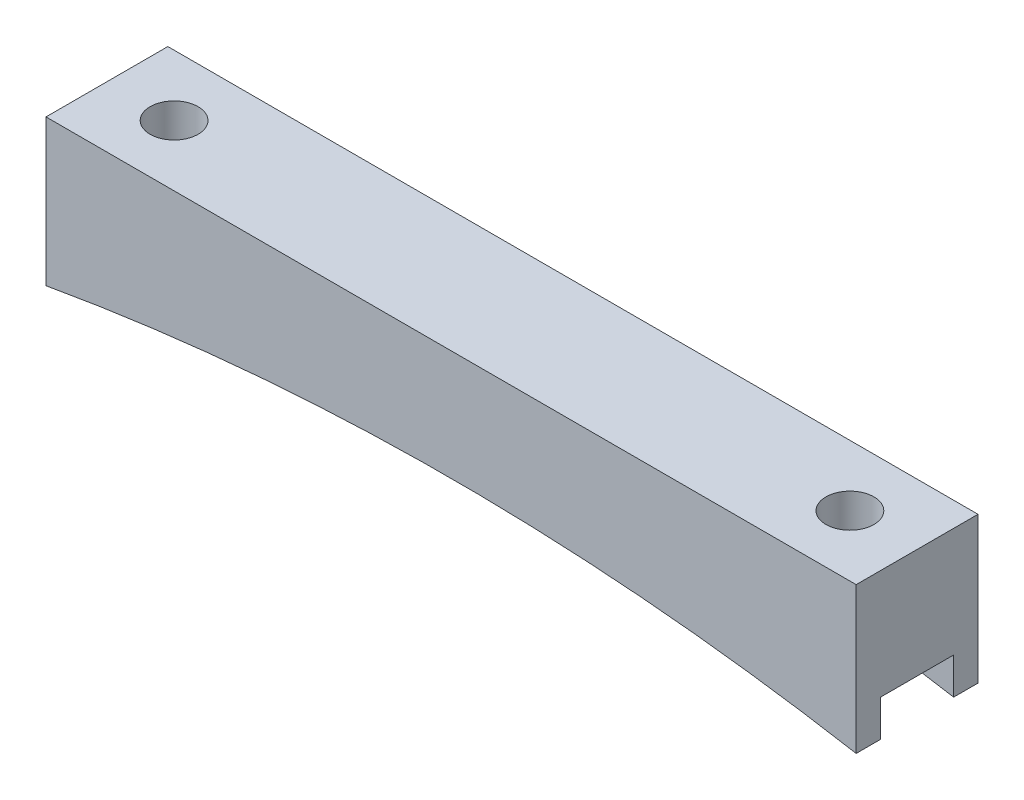
ISO-10303-21;
HEADER;
FILE_DESCRIPTION(('STEP AP214'),'2;1');
FILE_NAME('part.step','',(''),(''),'','','');
FILE_SCHEMA(('AUTOMOTIVE_DESIGN { 1 0 10303 214 1 1 1 1 }'));
ENDSEC;
DATA;
#1=APPLICATION_CONTEXT('core data for automotive mechanical design processes');
#2=APPLICATION_PROTOCOL_DEFINITION('international standard','automotive_design',2000,#1);
#3=PRODUCT_CONTEXT('',#1,'mechanical');
#4=PRODUCT('Part','Part','',(#3));
#5=PRODUCT_RELATED_PRODUCT_CATEGORY('part','',(#4));
#6=PRODUCT_DEFINITION_FORMATION('','',#4);
#7=PRODUCT_DEFINITION_CONTEXT('part definition',#1,'design');
#8=PRODUCT_DEFINITION('design','',#6,#7);
#9=PRODUCT_DEFINITION_SHAPE('','',#8);
#10=(LENGTH_UNIT() NAMED_UNIT(*) SI_UNIT(.MILLI.,.METRE.));
#11=(NAMED_UNIT(*) PLANE_ANGLE_UNIT() SI_UNIT($,.RADIAN.));
#12=(NAMED_UNIT(*) SI_UNIT($,.STERADIAN.) SOLID_ANGLE_UNIT());
#13=UNCERTAINTY_MEASURE_WITH_UNIT(LENGTH_MEASURE(1.E-05),#10,'distance_accuracy_value','');
#14=(GEOMETRIC_REPRESENTATION_CONTEXT(3) GLOBAL_UNCERTAINTY_ASSIGNED_CONTEXT((#13)) GLOBAL_UNIT_ASSIGNED_CONTEXT((#10,
#11,#12)) REPRESENTATION_CONTEXT('',''));
#15=CARTESIAN_POINT('',(0.,0.,0.));
#16=DIRECTION('',(0.,0.,1.));
#17=DIRECTION('',(1.,0.,0.));
#18=AXIS2_PLACEMENT_3D('',#15,#16,#17);
#19=CARTESIAN_POINT('',(0.,-252.817695922829,12.7));
#20=DIRECTION('',(0.,0.,-1.));
#21=DIRECTION('',(-1.,0.,0.));
#22=AXIS2_PLACEMENT_3D('',#19,#20,#21);
#23=CYLINDRICAL_SURFACE('',#22,241.3);
#24=DIRECTION('',(0.,0.,-1.));
#25=VECTOR('',#24,1.);
#26=CARTESIAN_POINT('',(-42.22,-15.24,12.7));
#27=LINE('',#26,#25);
#28=CARTESIAN_POINT('',(-42.22,-15.24,12.7));
#29=VERTEX_POINT('',#28);
#30=CARTESIAN_POINT('',(-42.22,-15.24,10.16));
#31=VERTEX_POINT('',#30);
#32=EDGE_CURVE('E132',#29,#31,#27,.T.);
#33=ORIENTED_EDGE('',*,*,#32,.T.);
#34=CARTESIAN_POINT('',(0.,-252.817695922829,10.16));
#35=DIRECTION('',(0.,0.,1.));
#36=DIRECTION('',(1.,0.,0.));
#37=AXIS2_PLACEMENT_3D('',#34,#35,#36);
#38=CIRCLE('',#37,241.3);
#39=CARTESIAN_POINT('',(42.22,-15.24,10.16));
#40=VERTEX_POINT('',#39);
#41=EDGE_CURVE('E11',#31,#40,#38,.F.);
#42=ORIENTED_EDGE('',*,*,#41,.T.);
#43=DIRECTION('',(0.,0.,-1.));
#44=VECTOR('',#43,1.);
#45=CARTESIAN_POINT('',(42.22,-15.24,12.7));
#46=LINE('',#45,#44);
#47=CARTESIAN_POINT('',(42.22,-15.24,12.7));
#48=VERTEX_POINT('',#47);
#49=EDGE_CURVE('E147',#48,#40,#46,.T.);
#50=ORIENTED_EDGE('',*,*,#49,.F.);
#51=CARTESIAN_POINT('',(0.,-252.817695922829,12.7));
#52=DIRECTION('',(0.,0.,-1.));
#53=DIRECTION('',(-1.,0.,0.));
#54=AXIS2_PLACEMENT_3D('',#51,#52,#53);
#55=CIRCLE('',#54,241.3);
#56=EDGE_CURVE('E68',#29,#48,#55,.T.);
#57=ORIENTED_EDGE('',*,*,#56,.F.);
#58=EDGE_LOOP('',(#33,#42,#50,#57));
#59=FACE_BOUND('',#58,.T.);
#60=ADVANCED_FACE('F43',(#59),#23,.F.);
#61=CARTESIAN_POINT('',(42.22,0.,12.7));
#62=DIRECTION('',(-1.,0.,0.));
#63=DIRECTION('',(0.,-1.,0.));
#64=AXIS2_PLACEMENT_3D('',#61,#62,#63);
#65=PLANE('',#64);
#66=ORIENTED_EDGE('',*,*,#49,.T.);
#67=DIRECTION('',(0.,-1.,0.));
#68=VECTOR('',#67,1.);
#69=CARTESIAN_POINT('',(42.22,-15.24,10.16));
#70=LINE('',#69,#68);
#71=CARTESIAN_POINT('',(42.22,-11.43,10.16));
#72=VERTEX_POINT('',#71);
#73=EDGE_CURVE('E124',#72,#40,#70,.T.);
#74=ORIENTED_EDGE('',*,*,#73,.F.);
#75=DIRECTION('',(0.,0.,1.));
#76=VECTOR('',#75,1.);
#77=CARTESIAN_POINT('',(42.22,-11.43,10.16));
#78=LINE('',#77,#76);
#79=CARTESIAN_POINT('',(42.22,-11.43,2.54));
#80=VERTEX_POINT('',#79);
#81=EDGE_CURVE('E136',#80,#72,#78,.T.);
#82=ORIENTED_EDGE('',*,*,#81,.F.);
#83=DIRECTION('',(0.,1.,0.));
#84=VECTOR('',#83,1.);
#85=CARTESIAN_POINT('',(42.22,-15.24,2.54));
#86=LINE('',#85,#84);
#87=CARTESIAN_POINT('',(42.22,-15.24,2.54));
#88=VERTEX_POINT('',#87);
#89=EDGE_CURVE('E210',#88,#80,#86,.T.);
#90=ORIENTED_EDGE('',*,*,#89,.F.);
#91=CARTESIAN_POINT('',(42.22,-15.24,0.));
#92=VERTEX_POINT('',#91);
#93=EDGE_CURVE('E90',#88,#92,#46,.T.);
#94=ORIENTED_EDGE('',*,*,#93,.T.);
#95=DIRECTION('',(0.,1.,0.));
#96=VECTOR('',#95,1.);
#97=CARTESIAN_POINT('',(42.22,0.,0.));
#98=LINE('',#97,#96);
#99=CARTESIAN_POINT('',(42.22,0.,0.));
#100=VERTEX_POINT('',#99);
#101=EDGE_CURVE('E174',#92,#100,#98,.T.);
#102=ORIENTED_EDGE('',*,*,#101,.T.);
#103=DIRECTION('',(0.,0.,-1.));
#104=VECTOR('',#103,1.);
#105=CARTESIAN_POINT('',(42.22,0.,12.7));
#106=LINE('',#105,#104);
#107=CARTESIAN_POINT('',(42.22,0.,12.7));
#108=VERTEX_POINT('',#107);
#109=EDGE_CURVE('E145',#108,#100,#106,.T.);
#110=ORIENTED_EDGE('',*,*,#109,.F.);
#111=DIRECTION('',(0.,1.,0.));
#112=VECTOR('',#111,1.);
#113=CARTESIAN_POINT('',(42.22,0.,12.7));
#114=LINE('',#113,#112);
#115=EDGE_CURVE('E176',#48,#108,#114,.T.);
#116=ORIENTED_EDGE('',*,*,#115,.F.);
#117=EDGE_LOOP('',(#66,#74,#82,#90,#94,#102,#110,#116));
#118=FACE_BOUND('',#117,.T.);
#119=ADVANCED_FACE('F45',(#118),#65,.F.);
#120=CARTESIAN_POINT('',(-42.22,0.,12.7));
#121=DIRECTION('',(0.,-1.,0.));
#122=DIRECTION('',(1.,0.,0.));
#123=AXIS2_PLACEMENT_3D('',#120,#121,#122);
#124=PLANE('',#123);
#125=CARTESIAN_POINT('',(-35.22,0.,6.35));
#126=DIRECTION('',(0.,1.,0.));
#127=DIRECTION('',(-1.,0.,0.));
#128=AXIS2_PLACEMENT_3D('',#125,#126,#127);
#129=CIRCLE('',#128,2.49999999999999);
#130=CARTESIAN_POINT('',(-37.72,0.,6.35));
#131=VERTEX_POINT('',#130);
#132=EDGE_CURVE('E184',#131,#131,#129,.T.);
#133=ORIENTED_EDGE('',*,*,#132,.F.);
#134=EDGE_LOOP('',(#133));
#135=FACE_BOUND('',#134,.T.);
#136=CARTESIAN_POINT('',(35.22,0.,6.35));
#137=DIRECTION('',(0.,1.,0.));
#138=DIRECTION('',(-1.,0.,0.));
#139=AXIS2_PLACEMENT_3D('',#136,#137,#138);
#140=CIRCLE('',#139,2.5);
#141=CARTESIAN_POINT('',(32.72,0.,6.35));
#142=VERTEX_POINT('',#141);
#143=EDGE_CURVE('E192',#142,#142,#140,.T.);
#144=ORIENTED_EDGE('',*,*,#143,.F.);
#145=EDGE_LOOP('',(#144));
#146=FACE_BOUND('',#145,.T.);
#147=DIRECTION('',(-1.,0.,0.));
#148=VECTOR('',#147,1.);
#149=CARTESIAN_POINT('',(-42.22,0.,0.));
#150=LINE('',#149,#148);
#151=CARTESIAN_POINT('',(-42.22,0.,0.));
#152=VERTEX_POINT('',#151);
#153=EDGE_CURVE('E170',#100,#152,#150,.T.);
#154=ORIENTED_EDGE('',*,*,#153,.T.);
#155=DIRECTION('',(0.,0.,-1.));
#156=VECTOR('',#155,1.);
#157=CARTESIAN_POINT('',(-42.22,0.,12.7));
#158=LINE('',#157,#156);
#159=CARTESIAN_POINT('',(-42.22,0.,12.7));
#160=VERTEX_POINT('',#159);
#161=EDGE_CURVE('E139',#160,#152,#158,.T.);
#162=ORIENTED_EDGE('',*,*,#161,.F.);
#163=DIRECTION('',(-1.,0.,0.));
#164=VECTOR('',#163,1.);
#165=CARTESIAN_POINT('',(-42.22,0.,12.7));
#166=LINE('',#165,#164);
#167=EDGE_CURVE('E98',#108,#160,#166,.T.);
#168=ORIENTED_EDGE('',*,*,#167,.F.);
#169=ORIENTED_EDGE('',*,*,#109,.T.);
#170=EDGE_LOOP('',(#154,#162,#168,#169));
#171=FACE_BOUND('',#170,.T.);
#172=ADVANCED_FACE('F235',(#135,#146,#171),#124,.F.);
#173=CARTESIAN_POINT('',(-42.22,0.,12.7));
#174=DIRECTION('',(1.,0.,0.));
#175=DIRECTION('',(0.,1.,0.));
#176=AXIS2_PLACEMENT_3D('',#173,#174,#175);
#177=PLANE('',#176);
#178=DIRECTION('',(0.,0.,1.));
#179=VECTOR('',#178,1.);
#180=CARTESIAN_POINT('',(-42.22,-11.43,10.16));
#181=LINE('',#180,#179);
#182=CARTESIAN_POINT('',(-42.22,-11.43,2.54));
#183=VERTEX_POINT('',#182);
#184=CARTESIAN_POINT('',(-42.22,-11.43,10.16));
#185=VERTEX_POINT('',#184);
#186=EDGE_CURVE('E134',#183,#185,#181,.T.);
#187=ORIENTED_EDGE('',*,*,#186,.T.);
#188=DIRECTION('',(0.,-1.,0.));
#189=VECTOR('',#188,1.);
#190=CARTESIAN_POINT('',(-42.22,-15.24,10.16));
#191=LINE('',#190,#189);
#192=EDGE_CURVE('E121',#185,#31,#191,.T.);
#193=ORIENTED_EDGE('',*,*,#192,.T.);
#194=ORIENTED_EDGE('',*,*,#32,.F.);
#195=DIRECTION('',(0.,-1.,0.));
#196=VECTOR('',#195,1.);
#197=CARTESIAN_POINT('',(-42.22,0.,12.7));
#198=LINE('',#197,#196);
#199=EDGE_CURVE('E187',#160,#29,#198,.T.);
#200=ORIENTED_EDGE('',*,*,#199,.F.);
#201=ORIENTED_EDGE('',*,*,#161,.T.);
#202=DIRECTION('',(0.,-1.,0.));
#203=VECTOR('',#202,1.);
#204=CARTESIAN_POINT('',(-42.22,0.,0.));
#205=LINE('',#204,#203);
#206=CARTESIAN_POINT('',(-42.22,-15.24,0.));
#207=VERTEX_POINT('',#206);
#208=EDGE_CURVE('E165',#152,#207,#205,.T.);
#209=ORIENTED_EDGE('',*,*,#208,.T.);
#210=CARTESIAN_POINT('',(-42.22,-15.24,2.54));
#211=VERTEX_POINT('',#210);
#212=EDGE_CURVE('E140',#211,#207,#27,.T.);
#213=ORIENTED_EDGE('',*,*,#212,.F.);
#214=DIRECTION('',(0.,1.,0.));
#215=VECTOR('',#214,1.);
#216=CARTESIAN_POINT('',(-42.22,-15.24,2.54));
#217=LINE('',#216,#215);
#218=EDGE_CURVE('E59',#211,#183,#217,.T.);
#219=ORIENTED_EDGE('',*,*,#218,.T.);
#220=EDGE_LOOP('',(#187,#193,#194,#200,#201,#209,#213,#219));
#221=FACE_BOUND('',#220,.T.);
#222=ADVANCED_FACE('F130',(#221),#177,.F.);
#223=ORIENTED_EDGE('',*,*,#93,.F.);
#224=CARTESIAN_POINT('',(0.,-252.817695922829,2.54));
#225=DIRECTION('',(0.,0.,-1.));
#226=DIRECTION('',(-1.,0.,0.));
#227=AXIS2_PLACEMENT_3D('',#224,#225,#226);
#228=CIRCLE('',#227,241.3);
#229=EDGE_CURVE('E52',#88,#211,#228,.F.);
#230=ORIENTED_EDGE('',*,*,#229,.T.);
#231=ORIENTED_EDGE('',*,*,#212,.T.);
#232=CARTESIAN_POINT('',(0.,-252.817695922829,0.));
#233=DIRECTION('',(0.,0.,-1.));
#234=DIRECTION('',(-1.,0.,0.));
#235=AXIS2_PLACEMENT_3D('',#232,#233,#234);
#236=CIRCLE('',#235,241.3);
#237=EDGE_CURVE('E169',#207,#92,#236,.T.);
#238=ORIENTED_EDGE('',*,*,#237,.T.);
#239=EDGE_LOOP('',(#223,#230,#231,#238));
#240=FACE_BOUND('',#239,.T.);
#241=ADVANCED_FACE('F161',(#240),#23,.F.);
#242=CARTESIAN_POINT('',(0.,-252.817695922829,12.7));
#243=DIRECTION('',(0.,0.,-1.));
#244=DIRECTION('',(-1.,0.,0.));
#245=AXIS2_PLACEMENT_3D('',#242,#243,#244);
#246=PLANE('',#245);
#247=ORIENTED_EDGE('',*,*,#115,.T.);
#248=ORIENTED_EDGE('',*,*,#167,.T.);
#249=ORIENTED_EDGE('',*,*,#199,.T.);
#250=ORIENTED_EDGE('',*,*,#56,.T.);
#251=EDGE_LOOP('',(#247,#248,#249,#250));
#252=FACE_BOUND('',#251,.T.);
#253=ADVANCED_FACE('F240',(#252),#246,.F.);
#254=CARTESIAN_POINT('',(0.,-252.817695922829,0.));
#255=DIRECTION('',(0.,0.,-1.));
#256=DIRECTION('',(-1.,0.,0.));
#257=AXIS2_PLACEMENT_3D('',#254,#255,#256);
#258=PLANE('',#257);
#259=ORIENTED_EDGE('',*,*,#101,.F.);
#260=ORIENTED_EDGE('',*,*,#237,.F.);
#261=ORIENTED_EDGE('',*,*,#208,.F.);
#262=ORIENTED_EDGE('',*,*,#153,.F.);
#263=EDGE_LOOP('',(#259,#260,#261,#262));
#264=FACE_BOUND('',#263,.T.);
#265=ADVANCED_FACE('F173',(#264),#258,.T.);
#266=CARTESIAN_POINT('',(35.22,-15.24,6.35));
#267=DIRECTION('',(0.,1.,0.));
#268=DIRECTION('',(-1.,0.,0.));
#269=AXIS2_PLACEMENT_3D('',#266,#267,#268);
#270=CYLINDRICAL_SURFACE('',#269,2.5);
#271=CARTESIAN_POINT('',(35.22,-11.43,6.35));
#272=DIRECTION('',(0.,1.,0.));
#273=DIRECTION('',(0.,0.,1.));
#274=AXIS2_PLACEMENT_3D('',#271,#272,#273);
#275=CIRCLE('',#274,2.5);
#276=CARTESIAN_POINT('',(35.22,-11.43,8.85));
#277=VERTEX_POINT('',#276);
#278=EDGE_CURVE('E156',#277,#277,#275,.F.);
#279=ORIENTED_EDGE('',*,*,#278,.T.);
#280=EDGE_LOOP('',(#279));
#281=FACE_BOUND('',#280,.T.);
#282=ORIENTED_EDGE('',*,*,#143,.T.);
#283=EDGE_LOOP('',(#282));
#284=FACE_BOUND('',#283,.T.);
#285=ADVANCED_FACE('F228',(#281,#284),#270,.F.);
#286=CARTESIAN_POINT('',(-35.22,-15.24,6.35));
#287=DIRECTION('',(0.,1.,0.));
#288=DIRECTION('',(-1.,0.,0.));
#289=AXIS2_PLACEMENT_3D('',#286,#287,#288);
#290=CYLINDRICAL_SURFACE('',#289,2.49999999999999);
#291=CARTESIAN_POINT('',(-35.22,-11.43,6.35));
#292=DIRECTION('',(0.,1.,0.));
#293=DIRECTION('',(0.,0.,1.));
#294=AXIS2_PLACEMENT_3D('',#291,#292,#293);
#295=CIRCLE('',#294,2.49999999999999);
#296=CARTESIAN_POINT('',(-35.22,-11.43,8.84999999999999));
#297=VERTEX_POINT('',#296);
#298=EDGE_CURVE('E153',#297,#297,#295,.F.);
#299=ORIENTED_EDGE('',*,*,#298,.T.);
#300=EDGE_LOOP('',(#299));
#301=FACE_BOUND('',#300,.T.);
#302=ORIENTED_EDGE('',*,*,#132,.T.);
#303=EDGE_LOOP('',(#302));
#304=FACE_BOUND('',#303,.T.);
#305=ADVANCED_FACE('F231',(#301,#304),#290,.F.);
#306=CARTESIAN_POINT('',(-42.22,-15.24,10.16));
#307=DIRECTION('',(0.,0.,1.));
#308=DIRECTION('',(1.,0.,0.));
#309=AXIS2_PLACEMENT_3D('',#306,#307,#308);
#310=PLANE('',#309);
#311=ORIENTED_EDGE('',*,*,#192,.F.);
#312=DIRECTION('',(1.,0.,0.));
#313=VECTOR('',#312,1.);
#314=CARTESIAN_POINT('',(-42.22,-11.43,10.16));
#315=LINE('',#314,#313);
#316=EDGE_CURVE('E157',#185,#72,#315,.T.);
#317=ORIENTED_EDGE('',*,*,#316,.T.);
#318=ORIENTED_EDGE('',*,*,#73,.T.);
#319=ORIENTED_EDGE('',*,*,#41,.F.);
#320=EDGE_LOOP('',(#311,#317,#318,#319));
#321=FACE_BOUND('',#320,.T.);
#322=ADVANCED_FACE('F120',(#321),#310,.F.);
#323=CARTESIAN_POINT('',(-42.22,-15.24,2.54));
#324=DIRECTION('',(0.,0.,-1.));
#325=DIRECTION('',(-1.,0.,0.));
#326=AXIS2_PLACEMENT_3D('',#323,#324,#325);
#327=PLANE('',#326);
#328=ORIENTED_EDGE('',*,*,#89,.T.);
#329=DIRECTION('',(1.,0.,0.));
#330=VECTOR('',#329,1.);
#331=CARTESIAN_POINT('',(-42.22,-11.43,2.54));
#332=LINE('',#331,#330);
#333=EDGE_CURVE('E202',#183,#80,#332,.T.);
#334=ORIENTED_EDGE('',*,*,#333,.F.);
#335=ORIENTED_EDGE('',*,*,#218,.F.);
#336=ORIENTED_EDGE('',*,*,#229,.F.);
#337=EDGE_LOOP('',(#328,#334,#335,#336));
#338=FACE_BOUND('',#337,.T.);
#339=ADVANCED_FACE('F219',(#338),#327,.F.);
#340=CARTESIAN_POINT('',(-42.22,-11.43,10.16));
#341=DIRECTION('',(0.,1.,0.));
#342=DIRECTION('',(0.,0.,1.));
#343=AXIS2_PLACEMENT_3D('',#340,#341,#342);
#344=PLANE('',#343);
#345=ORIENTED_EDGE('',*,*,#298,.F.);
#346=EDGE_LOOP('',(#345));
#347=FACE_BOUND('',#346,.T.);
#348=ORIENTED_EDGE('',*,*,#81,.T.);
#349=ORIENTED_EDGE('',*,*,#316,.F.);
#350=ORIENTED_EDGE('',*,*,#186,.F.);
#351=ORIENTED_EDGE('',*,*,#333,.T.);
#352=EDGE_LOOP('',(#348,#349,#350,#351));
#353=FACE_BOUND('',#352,.T.);
#354=ORIENTED_EDGE('',*,*,#278,.F.);
#355=EDGE_LOOP('',(#354));
#356=FACE_BOUND('',#355,.T.);
#357=ADVANCED_FACE('F221',(#347,#353,#356),#344,.F.);
#358=CLOSED_SHELL('',(#60,#119,#172,#222,#241,#253,#265,#285,#305,#322,#339,#357));
#359=MANIFOLD_SOLID_BREP('B2',#358);
#360=ADVANCED_BREP_SHAPE_REPRESENTATION('',(#18,#359),#14);
#361=SHAPE_DEFINITION_REPRESENTATION(#9,#360);
ENDSEC;
END-ISO-10303-21;
